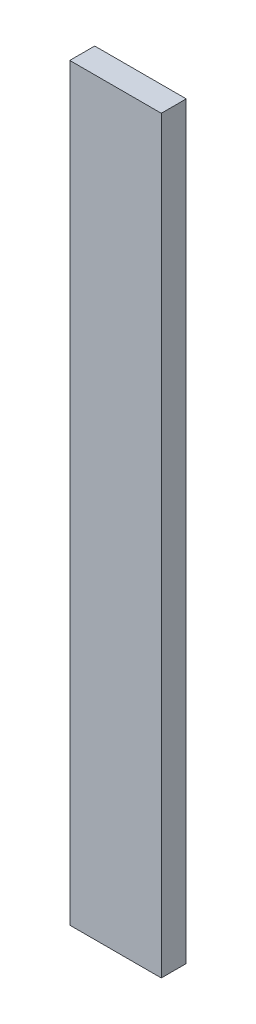
ISO-10303-21;
HEADER;
FILE_DESCRIPTION(('STEP AP214'),'2;1');
FILE_NAME('part.step','',(''),(''),'','','');
FILE_SCHEMA(('AUTOMOTIVE_DESIGN { 1 0 10303 214 1 1 1 1 }'));
ENDSEC;
DATA;
#1=APPLICATION_CONTEXT('core data for automotive mechanical design processes');
#2=APPLICATION_PROTOCOL_DEFINITION('international standard','automotive_design',2000,#1);
#3=PRODUCT_CONTEXT('',#1,'mechanical');
#4=PRODUCT('Part','Part','',(#3));
#5=PRODUCT_RELATED_PRODUCT_CATEGORY('part','',(#4));
#6=PRODUCT_DEFINITION_FORMATION('','',#4);
#7=PRODUCT_DEFINITION_CONTEXT('part definition',#1,'design');
#8=PRODUCT_DEFINITION('design','',#6,#7);
#9=PRODUCT_DEFINITION_SHAPE('','',#8);
#10=(LENGTH_UNIT() NAMED_UNIT(*) SI_UNIT(.MILLI.,.METRE.));
#11=(NAMED_UNIT(*) PLANE_ANGLE_UNIT() SI_UNIT($,.RADIAN.));
#12=(NAMED_UNIT(*) SI_UNIT($,.STERADIAN.) SOLID_ANGLE_UNIT());
#13=UNCERTAINTY_MEASURE_WITH_UNIT(LENGTH_MEASURE(1.E-05),#10,'distance_accuracy_value','');
#14=(GEOMETRIC_REPRESENTATION_CONTEXT(3) GLOBAL_UNCERTAINTY_ASSIGNED_CONTEXT((#13)) GLOBAL_UNIT_ASSIGNED_CONTEXT((#10,
#11,#12)) REPRESENTATION_CONTEXT('',''));
#15=CARTESIAN_POINT('',(0.,0.,0.));
#16=DIRECTION('',(0.,0.,1.));
#17=DIRECTION('',(1.,0.,0.));
#18=AXIS2_PLACEMENT_3D('',#15,#16,#17);
#19=CARTESIAN_POINT('',(-69.85,1143.,19.05));
#20=DIRECTION('',(-1.,0.,0.));
#21=DIRECTION('',(0.,0.,1.));
#22=AXIS2_PLACEMENT_3D('',#19,#20,#21);
#23=PLANE('',#22);
#24=DIRECTION('',(0.,0.,-1.));
#25=VECTOR('',#24,1.);
#26=CARTESIAN_POINT('',(-69.85,0.,19.05));
#27=LINE('',#26,#25);
#28=CARTESIAN_POINT('',(-69.85,0.,19.05));
#29=VERTEX_POINT('',#28);
#30=CARTESIAN_POINT('',(-69.85,0.,-19.05));
#31=VERTEX_POINT('',#30);
#32=EDGE_CURVE('E104',#29,#31,#27,.T.);
#33=ORIENTED_EDGE('',*,*,#32,.F.);
#34=DIRECTION('',(0.,-1.,0.));
#35=VECTOR('',#34,1.);
#36=CARTESIAN_POINT('',(-69.85,1143.,19.05));
#37=LINE('',#36,#35);
#38=CARTESIAN_POINT('',(-69.85,1143.,19.05));
#39=VERTEX_POINT('',#38);
#40=EDGE_CURVE('E11',#39,#29,#37,.T.);
#41=ORIENTED_EDGE('',*,*,#40,.F.);
#42=DIRECTION('',(0.,0.,-1.));
#43=VECTOR('',#42,1.);
#44=CARTESIAN_POINT('',(-69.85,1143.,19.05));
#45=LINE('',#44,#43);
#46=CARTESIAN_POINT('',(-69.85,1143.,-19.05));
#47=VERTEX_POINT('',#46);
#48=EDGE_CURVE('E99',#39,#47,#45,.T.);
#49=ORIENTED_EDGE('',*,*,#48,.T.);
#50=DIRECTION('',(0.,-1.,0.));
#51=VECTOR('',#50,1.);
#52=CARTESIAN_POINT('',(-69.85,1143.,-19.05));
#53=LINE('',#52,#51);
#54=EDGE_CURVE('E42',#47,#31,#53,.T.);
#55=ORIENTED_EDGE('',*,*,#54,.T.);
#56=EDGE_LOOP('',(#33,#41,#49,#55));
#57=FACE_BOUND('',#56,.T.);
#58=ADVANCED_FACE('F39',(#57),#23,.T.);
#59=CARTESIAN_POINT('',(-69.85,1143.,19.05));
#60=DIRECTION('',(0.,0.,-1.));
#61=DIRECTION('',(-1.,0.,0.));
#62=AXIS2_PLACEMENT_3D('',#59,#60,#61);
#63=PLANE('',#62);
#64=DIRECTION('',(1.,0.,0.));
#65=VECTOR('',#64,1.);
#66=CARTESIAN_POINT('',(-69.85,0.,19.05));
#67=LINE('',#66,#65);
#68=CARTESIAN_POINT('',(69.85,0.,19.05));
#69=VERTEX_POINT('',#68);
#70=EDGE_CURVE('E72',#29,#69,#67,.T.);
#71=ORIENTED_EDGE('',*,*,#70,.T.);
#72=DIRECTION('',(0.,-1.,0.));
#73=VECTOR('',#72,1.);
#74=CARTESIAN_POINT('',(69.85,1143.,19.05));
#75=LINE('',#74,#73);
#76=CARTESIAN_POINT('',(69.85,1143.,19.05));
#77=VERTEX_POINT('',#76);
#78=EDGE_CURVE('E48',#77,#69,#75,.T.);
#79=ORIENTED_EDGE('',*,*,#78,.F.);
#80=DIRECTION('',(1.,0.,0.));
#81=VECTOR('',#80,1.);
#82=CARTESIAN_POINT('',(-69.85,1143.,19.05));
#83=LINE('',#82,#81);
#84=EDGE_CURVE('E89',#39,#77,#83,.T.);
#85=ORIENTED_EDGE('',*,*,#84,.F.);
#86=ORIENTED_EDGE('',*,*,#40,.T.);
#87=EDGE_LOOP('',(#71,#79,#85,#86));
#88=FACE_BOUND('',#87,.T.);
#89=ADVANCED_FACE('F114',(#88),#63,.F.);
#90=CARTESIAN_POINT('',(69.85,1143.,19.05));
#91=DIRECTION('',(-1.,0.,0.));
#92=DIRECTION('',(0.,0.,1.));
#93=AXIS2_PLACEMENT_3D('',#90,#91,#92);
#94=PLANE('',#93);
#95=DIRECTION('',(0.,0.,-1.));
#96=VECTOR('',#95,1.);
#97=CARTESIAN_POINT('',(69.85,0.,19.05));
#98=LINE('',#97,#96);
#99=CARTESIAN_POINT('',(69.85,0.,-19.05));
#100=VERTEX_POINT('',#99);
#101=EDGE_CURVE('E96',#69,#100,#98,.T.);
#102=ORIENTED_EDGE('',*,*,#101,.T.);
#103=DIRECTION('',(0.,-1.,0.));
#104=VECTOR('',#103,1.);
#105=CARTESIAN_POINT('',(69.85,1143.,-19.05));
#106=LINE('',#105,#104);
#107=CARTESIAN_POINT('',(69.85,1143.,-19.05));
#108=VERTEX_POINT('',#107);
#109=EDGE_CURVE('E93',#108,#100,#106,.T.);
#110=ORIENTED_EDGE('',*,*,#109,.F.);
#111=DIRECTION('',(0.,0.,-1.));
#112=VECTOR('',#111,1.);
#113=CARTESIAN_POINT('',(69.85,1143.,19.05));
#114=LINE('',#113,#112);
#115=EDGE_CURVE('E84',#77,#108,#114,.T.);
#116=ORIENTED_EDGE('',*,*,#115,.F.);
#117=ORIENTED_EDGE('',*,*,#78,.T.);
#118=EDGE_LOOP('',(#102,#110,#116,#117));
#119=FACE_BOUND('',#118,.T.);
#120=ADVANCED_FACE('F94',(#119),#94,.F.);
#121=CARTESIAN_POINT('',(-69.85,1143.,-19.05));
#122=DIRECTION('',(0.,0.,-1.));
#123=DIRECTION('',(-1.,0.,0.));
#124=AXIS2_PLACEMENT_3D('',#121,#122,#123);
#125=PLANE('',#124);
#126=DIRECTION('',(1.,0.,0.));
#127=VECTOR('',#126,1.);
#128=CARTESIAN_POINT('',(-69.85,0.,-19.05));
#129=LINE('',#128,#127);
#130=EDGE_CURVE('E107',#31,#100,#129,.T.);
#131=ORIENTED_EDGE('',*,*,#130,.F.);
#132=ORIENTED_EDGE('',*,*,#54,.F.);
#133=DIRECTION('',(1.,0.,0.));
#134=VECTOR('',#133,1.);
#135=CARTESIAN_POINT('',(-69.85,1143.,-19.05));
#136=LINE('',#135,#134);
#137=EDGE_CURVE('E88',#47,#108,#136,.T.);
#138=ORIENTED_EDGE('',*,*,#137,.T.);
#139=ORIENTED_EDGE('',*,*,#109,.T.);
#140=EDGE_LOOP('',(#131,#132,#138,#139));
#141=FACE_BOUND('',#140,.T.);
#142=ADVANCED_FACE('F98',(#141),#125,.T.);
#143=CARTESIAN_POINT('',(0.,1143.,0.));
#144=DIRECTION('',(0.,-1.,0.));
#145=DIRECTION('',(0.,0.,-1.));
#146=AXIS2_PLACEMENT_3D('',#143,#144,#145);
#147=PLANE('',#146);
#148=ORIENTED_EDGE('',*,*,#48,.F.);
#149=ORIENTED_EDGE('',*,*,#84,.T.);
#150=ORIENTED_EDGE('',*,*,#115,.T.);
#151=ORIENTED_EDGE('',*,*,#137,.F.);
#152=EDGE_LOOP('',(#148,#149,#150,#151));
#153=FACE_BOUND('',#152,.T.);
#154=ADVANCED_FACE('F87',(#153),#147,.F.);
#155=CARTESIAN_POINT('',(0.,0.,0.));
#156=DIRECTION('',(0.,-1.,0.));
#157=DIRECTION('',(0.,0.,-1.));
#158=AXIS2_PLACEMENT_3D('',#155,#156,#157);
#159=PLANE('',#158);
#160=ORIENTED_EDGE('',*,*,#32,.T.);
#161=ORIENTED_EDGE('',*,*,#130,.T.);
#162=ORIENTED_EDGE('',*,*,#101,.F.);
#163=ORIENTED_EDGE('',*,*,#70,.F.);
#164=EDGE_LOOP('',(#160,#161,#162,#163));
#165=FACE_BOUND('',#164,.T.);
#166=ADVANCED_FACE('F112',(#165),#159,.T.);
#167=CLOSED_SHELL('',(#58,#89,#120,#142,#154,#166));
#168=MANIFOLD_SOLID_BREP('B2',#167);
#169=ADVANCED_BREP_SHAPE_REPRESENTATION('',(#18,#168),#14);
#170=SHAPE_DEFINITION_REPRESENTATION(#9,#169);
ENDSEC;
END-ISO-10303-21;
